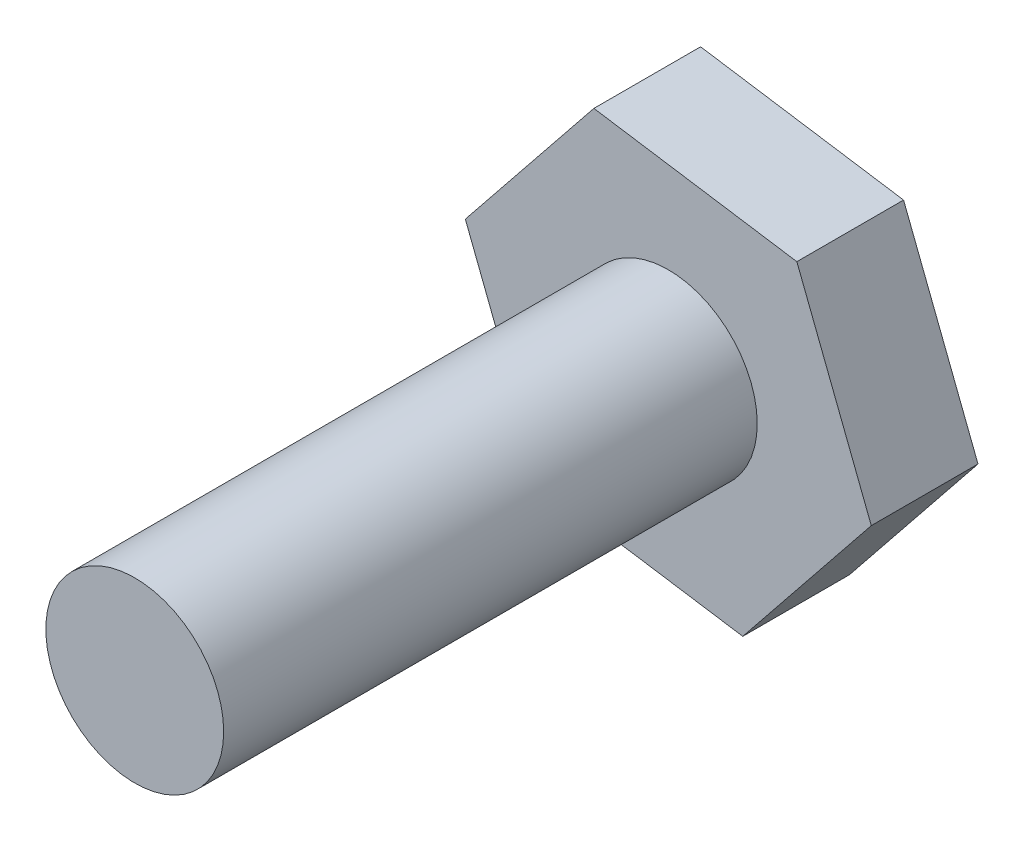
ISO-10303-21;
HEADER;
FILE_DESCRIPTION(('STEP AP214'),'2;1');
FILE_NAME('part.step','',(''),(''),'','','');
FILE_SCHEMA(('AUTOMOTIVE_DESIGN { 1 0 10303 214 1 1 1 1 }'));
ENDSEC;
DATA;
#1=APPLICATION_CONTEXT('core data for automotive mechanical design processes');
#2=APPLICATION_PROTOCOL_DEFINITION('international standard','automotive_design',2000,#1);
#3=PRODUCT_CONTEXT('',#1,'mechanical');
#4=PRODUCT('Part','Part','',(#3));
#5=PRODUCT_RELATED_PRODUCT_CATEGORY('part','',(#4));
#6=PRODUCT_DEFINITION_FORMATION('','',#4);
#7=PRODUCT_DEFINITION_CONTEXT('part definition',#1,'design');
#8=PRODUCT_DEFINITION('design','',#6,#7);
#9=PRODUCT_DEFINITION_SHAPE('','',#8);
#10=(LENGTH_UNIT() NAMED_UNIT(*) SI_UNIT(.MILLI.,.METRE.));
#11=(NAMED_UNIT(*) PLANE_ANGLE_UNIT() SI_UNIT($,.RADIAN.));
#12=(NAMED_UNIT(*) SI_UNIT($,.STERADIAN.) SOLID_ANGLE_UNIT());
#13=UNCERTAINTY_MEASURE_WITH_UNIT(LENGTH_MEASURE(1.E-05),#10,'distance_accuracy_value','');
#14=(GEOMETRIC_REPRESENTATION_CONTEXT(3) GLOBAL_UNCERTAINTY_ASSIGNED_CONTEXT((#13)) GLOBAL_UNIT_ASSIGNED_CONTEXT((#10,
#11,#12)) REPRESENTATION_CONTEXT('',''));
#15=CARTESIAN_POINT('',(0.,0.,0.));
#16=DIRECTION('',(0.,0.,1.));
#17=DIRECTION('',(1.,0.,0.));
#18=AXIS2_PLACEMENT_3D('',#15,#16,#17);
#19=CARTESIAN_POINT('',(0.,0.,3.));
#20=DIRECTION('',(0.,0.,1.));
#21=DIRECTION('',(1.,0.,0.));
#22=AXIS2_PLACEMENT_3D('',#19,#20,#21);
#23=PLANE('',#22);
#24=DIRECTION('',(0.98836285257801,-0.152114666103763,0.));
#25=VECTOR('',#24,1.);
#26=CARTESIAN_POINT('',(-60.0929519376663,5.17809821649077,3.));
#27=LINE('',#26,#25);
#28=CARTESIAN_POINT('',(-60.0929519376663,5.17809821649077,3.));
#29=VERTEX_POINT('',#28);
#30=CARTESIAN_POINT('',(-54.3866363477368,4.2998637822638,3.));
#31=VERTEX_POINT('',#30);
#32=EDGE_CURVE('E129',#29,#31,#27,.T.);
#33=ORIENTED_EDGE('',*,*,#32,.T.);
#34=DIRECTION('',(0.625916591423051,0.779890005437529,0.));
#35=VECTOR('',#34,1.);
#36=CARTESIAN_POINT('',(-54.3866363477368,4.2998637822638,3.));
#37=LINE('',#36,#35);
#38=CARTESIAN_POINT('',(-50.7729052222533,8.80256082804037,3.));
#39=VERTEX_POINT('',#38);
#40=EDGE_CURVE('E87',#31,#39,#37,.T.);
#41=ORIENTED_EDGE('',*,*,#40,.T.);
#42=DIRECTION('',(-0.362446261154959,0.932004671541292,0.));
#43=VECTOR('',#42,1.);
#44=CARTESIAN_POINT('',(-50.7729052222533,8.80256082804037,3.));
#45=LINE('',#44,#43);
#46=CARTESIAN_POINT('',(-52.8654896866992,14.1834923080439,3.));
#47=VERTEX_POINT('',#46);
#48=EDGE_CURVE('E100',#39,#47,#45,.T.);
#49=ORIENTED_EDGE('',*,*,#48,.T.);
#50=DIRECTION('',(-0.98836285257801,0.152114666103762,0.));
#51=VECTOR('',#50,1.);
#52=CARTESIAN_POINT('',(-52.8654896866992,14.1834923080439,3.));
#53=LINE('',#52,#51);
#54=CARTESIAN_POINT('',(-58.5718052766286,15.0617267422709,3.));
#55=VERTEX_POINT('',#54);
#56=EDGE_CURVE('E94',#47,#55,#53,.T.);
#57=ORIENTED_EDGE('',*,*,#56,.T.);
#58=DIRECTION('',(-0.625916591423051,-0.779890005437529,0.));
#59=VECTOR('',#58,1.);
#60=CARTESIAN_POINT('',(-58.5718052766286,15.0617267422709,3.));
#61=LINE('',#60,#59);
#62=CARTESIAN_POINT('',(-62.1855364021122,10.5590296964943,3.));
#63=VERTEX_POINT('',#62);
#64=EDGE_CURVE('E98',#55,#63,#61,.T.);
#65=ORIENTED_EDGE('',*,*,#64,.T.);
#66=DIRECTION('',(0.362446261154959,-0.932004671541292,0.));
#67=VECTOR('',#66,1.);
#68=CARTESIAN_POINT('',(-62.1855364021122,10.5590296964943,3.));
#69=LINE('',#68,#67);
#70=EDGE_CURVE('E50',#63,#29,#69,.T.);
#71=ORIENTED_EDGE('',*,*,#70,.T.);
#72=EDGE_LOOP('',(#33,#41,#49,#57,#65,#71));
#73=FACE_BOUND('',#72,.T.);
#74=CARTESIAN_POINT('',(-56.4792208121828,9.68079526226739,3.));
#75=DIRECTION('',(0.,0.,1.));
#76=DIRECTION('',(1.,0.,0.));
#77=AXIS2_PLACEMENT_3D('',#74,#75,#76);
#78=CIRCLE('',#77,2.5);
#79=CARTESIAN_POINT('',(-53.9792208121828,9.68079526226739,3.));
#80=VERTEX_POINT('',#79);
#81=EDGE_CURVE('E122',#80,#80,#78,.F.);
#82=ORIENTED_EDGE('',*,*,#81,.T.);
#83=EDGE_LOOP('',(#82));
#84=FACE_BOUND('',#83,.T.);
#85=ADVANCED_FACE('F33',(#73,#84),#23,.T.);
#86=CARTESIAN_POINT('',(-60.0929519376663,5.17809821649077,3.));
#87=DIRECTION('',(0.152114666103763,0.98836285257801,0.));
#88=DIRECTION('',(-0.98836285257801,0.152114666103763,0.));
#89=AXIS2_PLACEMENT_3D('',#86,#87,#88);
#90=PLANE('',#89);
#91=DIRECTION('',(0.98836285257801,-0.152114666103763,0.));
#92=VECTOR('',#91,1.);
#93=CARTESIAN_POINT('',(-60.0929519376663,5.17809821649077,0.));
#94=LINE('',#93,#92);
#95=CARTESIAN_POINT('',(-60.0929519376663,5.17809821649077,0.));
#96=VERTEX_POINT('',#95);
#97=CARTESIAN_POINT('',(-54.3866363477368,4.2998637822638,0.));
#98=VERTEX_POINT('',#97);
#99=EDGE_CURVE('E118',#96,#98,#94,.T.);
#100=ORIENTED_EDGE('',*,*,#99,.T.);
#101=DIRECTION('',(0.,0.,-1.));
#102=VECTOR('',#101,1.);
#103=CARTESIAN_POINT('',(-54.3866363477368,4.2998637822638,3.));
#104=LINE('',#103,#102);
#105=EDGE_CURVE('E11',#31,#98,#104,.T.);
#106=ORIENTED_EDGE('',*,*,#105,.F.);
#107=ORIENTED_EDGE('',*,*,#32,.F.);
#108=DIRECTION('',(0.,0.,-1.));
#109=VECTOR('',#108,1.);
#110=CARTESIAN_POINT('',(-60.0929519376663,5.17809821649077,3.));
#111=LINE('',#110,#109);
#112=EDGE_CURVE('E114',#29,#96,#111,.T.);
#113=ORIENTED_EDGE('',*,*,#112,.T.);
#114=EDGE_LOOP('',(#100,#106,#107,#113));
#115=FACE_BOUND('',#114,.T.);
#116=ADVANCED_FACE('F35',(#115),#90,.F.);
#117=CARTESIAN_POINT('',(-54.3866363477368,4.2998637822638,3.));
#118=DIRECTION('',(-0.779890005437529,0.625916591423051,0.));
#119=DIRECTION('',(-0.625916591423052,-0.779890005437529,0.));
#120=AXIS2_PLACEMENT_3D('',#117,#118,#119);
#121=PLANE('',#120);
#122=DIRECTION('',(0.625916591423051,0.779890005437529,0.));
#123=VECTOR('',#122,1.);
#124=CARTESIAN_POINT('',(-54.3866363477368,4.2998637822638,0.));
#125=LINE('',#124,#123);
#126=CARTESIAN_POINT('',(-50.7729052222533,8.80256082804037,0.));
#127=VERTEX_POINT('',#126);
#128=EDGE_CURVE('E121',#98,#127,#125,.T.);
#129=ORIENTED_EDGE('',*,*,#128,.T.);
#130=DIRECTION('',(0.,0.,-1.));
#131=VECTOR('',#130,1.);
#132=CARTESIAN_POINT('',(-50.7729052222533,8.80256082804037,3.));
#133=LINE('',#132,#131);
#134=EDGE_CURVE('E42',#39,#127,#133,.T.);
#135=ORIENTED_EDGE('',*,*,#134,.F.);
#136=ORIENTED_EDGE('',*,*,#40,.F.);
#137=ORIENTED_EDGE('',*,*,#105,.T.);
#138=EDGE_LOOP('',(#129,#135,#136,#137));
#139=FACE_BOUND('',#138,.T.);
#140=ADVANCED_FACE('F158',(#139),#121,.F.);
#141=CARTESIAN_POINT('',(-50.7729052222533,8.80256082804037,3.));
#142=DIRECTION('',(-0.932004671541292,-0.362446261154959,0.));
#143=DIRECTION('',(0.362446261154959,-0.932004671541292,0.));
#144=AXIS2_PLACEMENT_3D('',#141,#142,#143);
#145=PLANE('',#144);
#146=DIRECTION('',(-0.362446261154959,0.932004671541292,0.));
#147=VECTOR('',#146,1.);
#148=CARTESIAN_POINT('',(-50.7729052222533,8.80256082804037,0.));
#149=LINE('',#148,#147);
#150=CARTESIAN_POINT('',(-52.8654896866992,14.1834923080439,0.));
#151=VERTEX_POINT('',#150);
#152=EDGE_CURVE('E124',#127,#151,#149,.T.);
#153=ORIENTED_EDGE('',*,*,#152,.T.);
#154=DIRECTION('',(0.,0.,-1.));
#155=VECTOR('',#154,1.);
#156=CARTESIAN_POINT('',(-52.8654896866992,14.1834923080439,3.));
#157=LINE('',#156,#155);
#158=EDGE_CURVE('E109',#47,#151,#157,.T.);
#159=ORIENTED_EDGE('',*,*,#158,.F.);
#160=ORIENTED_EDGE('',*,*,#48,.F.);
#161=ORIENTED_EDGE('',*,*,#134,.T.);
#162=EDGE_LOOP('',(#153,#159,#160,#161));
#163=FACE_BOUND('',#162,.T.);
#164=ADVANCED_FACE('F135',(#163),#145,.F.);
#165=CARTESIAN_POINT('',(-52.8654896866992,14.1834923080439,3.));
#166=DIRECTION('',(-0.152114666103762,-0.98836285257801,0.));
#167=DIRECTION('',(0.98836285257801,-0.152114666103762,0.));
#168=AXIS2_PLACEMENT_3D('',#165,#166,#167);
#169=PLANE('',#168);
#170=DIRECTION('',(-0.98836285257801,0.152114666103762,0.));
#171=VECTOR('',#170,1.);
#172=CARTESIAN_POINT('',(-52.8654896866992,14.1834923080439,0.));
#173=LINE('',#172,#171);
#174=CARTESIAN_POINT('',(-58.5718052766286,15.0617267422709,0.));
#175=VERTEX_POINT('',#174);
#176=EDGE_CURVE('E108',#151,#175,#173,.T.);
#177=ORIENTED_EDGE('',*,*,#176,.T.);
#178=DIRECTION('',(0.,0.,-1.));
#179=VECTOR('',#178,1.);
#180=CARTESIAN_POINT('',(-58.5718052766286,15.0617267422709,3.));
#181=LINE('',#180,#179);
#182=EDGE_CURVE('E105',#55,#175,#181,.T.);
#183=ORIENTED_EDGE('',*,*,#182,.F.);
#184=ORIENTED_EDGE('',*,*,#56,.F.);
#185=ORIENTED_EDGE('',*,*,#158,.T.);
#186=EDGE_LOOP('',(#177,#183,#184,#185));
#187=FACE_BOUND('',#186,.T.);
#188=ADVANCED_FACE('F106',(#187),#169,.F.);
#189=CARTESIAN_POINT('',(-58.5718052766286,15.0617267422709,3.));
#190=DIRECTION('',(0.779890005437529,-0.625916591423051,0.));
#191=DIRECTION('',(0.625916591423051,0.779890005437529,0.));
#192=AXIS2_PLACEMENT_3D('',#189,#190,#191);
#193=PLANE('',#192);
#194=DIRECTION('',(-0.625916591423051,-0.779890005437529,0.));
#195=VECTOR('',#194,1.);
#196=CARTESIAN_POINT('',(-58.5718052766286,15.0617267422709,0.));
#197=LINE('',#196,#195);
#198=CARTESIAN_POINT('',(-62.1855364021122,10.5590296964943,0.));
#199=VERTEX_POINT('',#198);
#200=EDGE_CURVE('E73',#175,#199,#197,.T.);
#201=ORIENTED_EDGE('',*,*,#200,.T.);
#202=DIRECTION('',(0.,0.,-1.));
#203=VECTOR('',#202,1.);
#204=CARTESIAN_POINT('',(-62.1855364021122,10.5590296964943,3.));
#205=LINE('',#204,#203);
#206=EDGE_CURVE('E110',#63,#199,#205,.T.);
#207=ORIENTED_EDGE('',*,*,#206,.F.);
#208=ORIENTED_EDGE('',*,*,#64,.F.);
#209=ORIENTED_EDGE('',*,*,#182,.T.);
#210=EDGE_LOOP('',(#201,#207,#208,#209));
#211=FACE_BOUND('',#210,.T.);
#212=ADVANCED_FACE('F112',(#211),#193,.F.);
#213=CARTESIAN_POINT('',(-62.1855364021122,10.5590296964943,3.));
#214=DIRECTION('',(0.932004671541292,0.362446261154959,0.));
#215=DIRECTION('',(-0.362446261154959,0.932004671541292,0.));
#216=AXIS2_PLACEMENT_3D('',#213,#214,#215);
#217=PLANE('',#216);
#218=DIRECTION('',(0.362446261154959,-0.932004671541292,0.));
#219=VECTOR('',#218,1.);
#220=CARTESIAN_POINT('',(-62.1855364021122,10.5590296964943,0.));
#221=LINE('',#220,#219);
#222=EDGE_CURVE('E79',#199,#96,#221,.T.);
#223=ORIENTED_EDGE('',*,*,#222,.T.);
#224=ORIENTED_EDGE('',*,*,#112,.F.);
#225=ORIENTED_EDGE('',*,*,#70,.F.);
#226=ORIENTED_EDGE('',*,*,#206,.T.);
#227=EDGE_LOOP('',(#223,#224,#225,#226));
#228=FACE_BOUND('',#227,.T.);
#229=ADVANCED_FACE('F142',(#228),#217,.F.);
#230=CARTESIAN_POINT('',(0.,0.,0.));
#231=DIRECTION('',(0.,0.,1.));
#232=DIRECTION('',(1.,0.,0.));
#233=AXIS2_PLACEMENT_3D('',#230,#231,#232);
#234=PLANE('',#233);
#235=ORIENTED_EDGE('',*,*,#99,.F.);
#236=ORIENTED_EDGE('',*,*,#222,.F.);
#237=ORIENTED_EDGE('',*,*,#200,.F.);
#238=ORIENTED_EDGE('',*,*,#176,.F.);
#239=ORIENTED_EDGE('',*,*,#152,.F.);
#240=ORIENTED_EDGE('',*,*,#128,.F.);
#241=EDGE_LOOP('',(#235,#236,#237,#238,#239,#240));
#242=FACE_BOUND('',#241,.T.);
#243=ADVANCED_FACE('F138',(#242),#234,.F.);
#244=CARTESIAN_POINT('',(-56.4792208121828,9.68079526226739,18.));
#245=DIRECTION('',(0.,0.,-1.));
#246=DIRECTION('',(-1.,0.,0.));
#247=AXIS2_PLACEMENT_3D('',#244,#245,#246);
#248=CYLINDRICAL_SURFACE('',#247,2.5);
#249=ORIENTED_EDGE('',*,*,#81,.F.);
#250=EDGE_LOOP('',(#249));
#251=FACE_BOUND('',#250,.T.);
#252=CARTESIAN_POINT('',(-56.4792208121828,9.68079526226739,18.));
#253=DIRECTION('',(0.,0.,1.));
#254=DIRECTION('',(1.,0.,0.));
#255=AXIS2_PLACEMENT_3D('',#252,#253,#254);
#256=CIRCLE('',#255,2.5);
#257=CARTESIAN_POINT('',(-53.9792208121828,9.68079526226739,18.));
#258=VERTEX_POINT('',#257);
#259=EDGE_CURVE('E170',#258,#258,#256,.T.);
#260=ORIENTED_EDGE('',*,*,#259,.F.);
#261=EDGE_LOOP('',(#260));
#262=FACE_BOUND('',#261,.T.);
#263=ADVANCED_FACE('F150',(#251,#262),#248,.T.);
#264=CARTESIAN_POINT('',(-56.4792208121828,9.68079526226739,18.));
#265=DIRECTION('',(0.,0.,1.));
#266=DIRECTION('',(1.,0.,0.));
#267=AXIS2_PLACEMENT_3D('',#264,#265,#266);
#268=PLANE('',#267);
#269=ORIENTED_EDGE('',*,*,#259,.T.);
#270=EDGE_LOOP('',(#269));
#271=FACE_BOUND('',#270,.T.);
#272=ADVANCED_FACE('F162',(#271),#268,.T.);
#273=CLOSED_SHELL('',(#85,#116,#140,#164,#188,#212,#229,#243,#263,#272));
#274=MANIFOLD_SOLID_BREP('B2',#273);
#275=ADVANCED_BREP_SHAPE_REPRESENTATION('',(#18,#274),#14);
#276=SHAPE_DEFINITION_REPRESENTATION(#9,#275);
ENDSEC;
END-ISO-10303-21;
